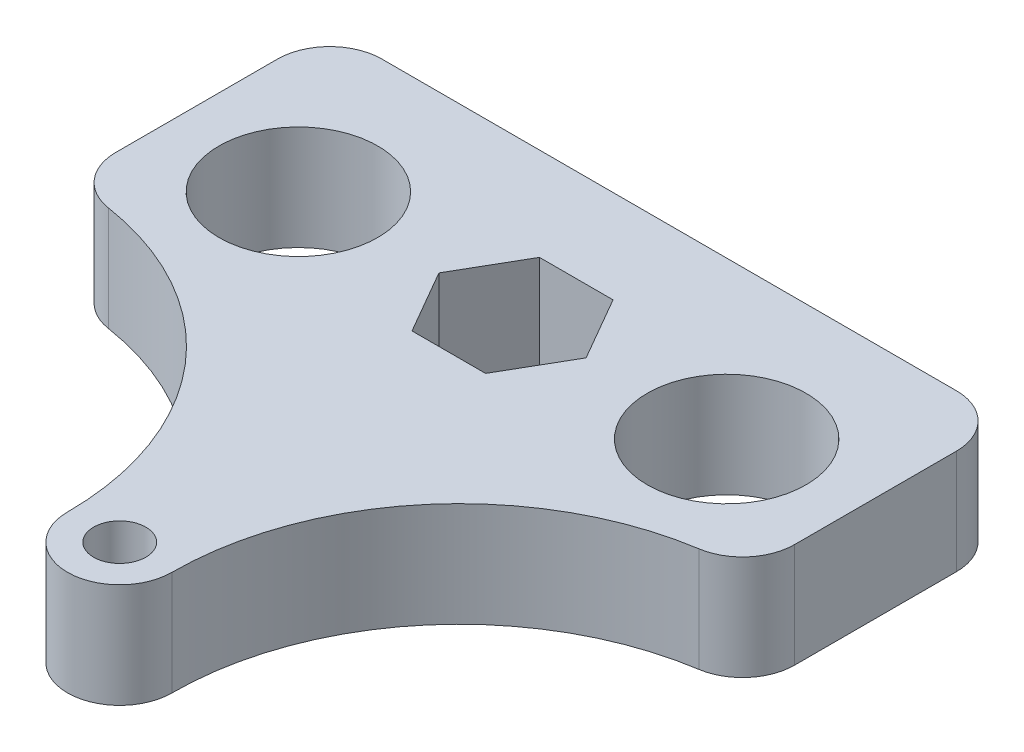
ISO-10303-21;
HEADER;
FILE_DESCRIPTION(('STEP AP214'),'2;1');
FILE_NAME('part.step','',(''),(''),'','','');
FILE_SCHEMA(('AUTOMOTIVE_DESIGN { 1 0 10303 214 1 1 1 1 }'));
ENDSEC;
DATA;
#1=APPLICATION_CONTEXT('core data for automotive mechanical design processes');
#2=APPLICATION_PROTOCOL_DEFINITION('international standard','automotive_design',2000,#1);
#3=PRODUCT_CONTEXT('',#1,'mechanical');
#4=PRODUCT('Part','Part','',(#3));
#5=PRODUCT_RELATED_PRODUCT_CATEGORY('part','',(#4));
#6=PRODUCT_DEFINITION_FORMATION('','',#4);
#7=PRODUCT_DEFINITION_CONTEXT('part definition',#1,'design');
#8=PRODUCT_DEFINITION('design','',#6,#7);
#9=PRODUCT_DEFINITION_SHAPE('','',#8);
#10=(LENGTH_UNIT() NAMED_UNIT(*) SI_UNIT(.MILLI.,.METRE.));
#11=(NAMED_UNIT(*) PLANE_ANGLE_UNIT() SI_UNIT($,.RADIAN.));
#12=(NAMED_UNIT(*) SI_UNIT($,.STERADIAN.) SOLID_ANGLE_UNIT());
#13=UNCERTAINTY_MEASURE_WITH_UNIT(LENGTH_MEASURE(1.E-05),#10,'distance_accuracy_value','');
#14=(GEOMETRIC_REPRESENTATION_CONTEXT(3) GLOBAL_UNCERTAINTY_ASSIGNED_CONTEXT((#13)) GLOBAL_UNIT_ASSIGNED_CONTEXT((#10,
#11,#12)) REPRESENTATION_CONTEXT('',''));
#15=CARTESIAN_POINT('',(0.,0.,0.));
#16=DIRECTION('',(0.,0.,1.));
#17=DIRECTION('',(1.,0.,0.));
#18=AXIS2_PLACEMENT_3D('',#15,#16,#17);
#19=CARTESIAN_POINT('',(32.5,10.,27.5));
#20=DIRECTION('',(0.,-1.,0.));
#21=DIRECTION('',(0.,0.,-1.));
#22=AXIS2_PLACEMENT_3D('',#19,#20,#21);
#23=PLANE('',#22);
#24=CARTESIAN_POINT('',(0.,10.,27.5));
#25=DIRECTION('',(0.,1.,0.));
#26=DIRECTION('',(0.,0.,1.));
#27=AXIS2_PLACEMENT_3D('',#24,#25,#26);
#28=CIRCLE('',#27,2.5);
#29=CARTESIAN_POINT('',(0.,10.,30.));
#30=VERTEX_POINT('',#29);
#31=EDGE_CURVE('E200',#30,#30,#28,.T.);
#32=ORIENTED_EDGE('',*,*,#31,.F.);
#33=EDGE_LOOP('',(#32));
#34=FACE_BOUND('',#33,.T.);
#35=CARTESIAN_POINT('',(32.5,10.,27.5));
#36=DIRECTION('',(0.,-1.,0.));
#37=DIRECTION('',(0.,0.,-1.));
#38=AXIS2_PLACEMENT_3D('',#35,#36,#37);
#39=CIRCLE('',#38,27.5);
#40=CARTESIAN_POINT('',(5.,10.,27.5));
#41=VERTEX_POINT('',#40);
#42=CARTESIAN_POINT('',(28.2692307692308,10.,0.327392622054533));
#43=VERTEX_POINT('',#42);
#44=EDGE_CURVE('E206',#41,#43,#39,.T.);
#45=ORIENTED_EDGE('',*,*,#44,.T.);
#46=CARTESIAN_POINT('',(27.5000000000001,10.,-4.61308144666283));
#47=DIRECTION('',(0.,1.,0.));
#48=DIRECTION('',(0.,0.,1.));
#49=AXIS2_PLACEMENT_3D('',#46,#47,#48);
#50=CIRCLE('',#49,5.);
#51=CARTESIAN_POINT('',(32.5000000000001,10.,-4.61308144666284));
#52=VERTEX_POINT('',#51);
#53=EDGE_CURVE('E209',#43,#52,#50,.T.);
#54=ORIENTED_EDGE('',*,*,#53,.T.);
#55=DIRECTION('',(0.,0.,-1.));
#56=VECTOR('',#55,1.);
#57=CARTESIAN_POINT('',(32.5,10.,-20.1));
#58=LINE('',#57,#56);
#59=CARTESIAN_POINT('',(32.5,10.,-20.1));
#60=VERTEX_POINT('',#59);
#61=EDGE_CURVE('E212',#52,#60,#58,.T.);
#62=ORIENTED_EDGE('',*,*,#61,.T.);
#63=CARTESIAN_POINT('',(27.5,10.,-20.1));
#64=DIRECTION('',(0.,1.,0.));
#65=DIRECTION('',(0.,0.,-1.));
#66=AXIS2_PLACEMENT_3D('',#63,#64,#65);
#67=CIRCLE('',#66,5.);
#68=CARTESIAN_POINT('',(27.5,10.,-25.1));
#69=VERTEX_POINT('',#68);
#70=EDGE_CURVE('E214',#60,#69,#67,.T.);
#71=ORIENTED_EDGE('',*,*,#70,.T.);
#72=DIRECTION('',(-1.,0.,0.));
#73=VECTOR('',#72,1.);
#74=CARTESIAN_POINT('',(-27.5,10.,-25.1));
#75=LINE('',#74,#73);
#76=CARTESIAN_POINT('',(-27.5,10.,-25.1));
#77=VERTEX_POINT('',#76);
#78=EDGE_CURVE('E216',#69,#77,#75,.T.);
#79=ORIENTED_EDGE('',*,*,#78,.T.);
#80=CARTESIAN_POINT('',(-27.5,10.,-20.1));
#81=DIRECTION('',(0.,1.,0.));
#82=DIRECTION('',(0.,0.,1.));
#83=AXIS2_PLACEMENT_3D('',#80,#81,#82);
#84=CIRCLE('',#83,5.);
#85=CARTESIAN_POINT('',(-32.5,10.,-20.1));
#86=VERTEX_POINT('',#85);
#87=EDGE_CURVE('E218',#77,#86,#84,.T.);
#88=ORIENTED_EDGE('',*,*,#87,.T.);
#89=DIRECTION('',(0.,0.,1.));
#90=VECTOR('',#89,1.);
#91=CARTESIAN_POINT('',(-32.5000000000001,10.,-4.61308144666284));
#92=LINE('',#91,#90);
#93=CARTESIAN_POINT('',(-32.5000000000001,10.,-4.61308144666284));
#94=VERTEX_POINT('',#93);
#95=EDGE_CURVE('E220',#86,#94,#92,.T.);
#96=ORIENTED_EDGE('',*,*,#95,.T.);
#97=CARTESIAN_POINT('',(-27.5000000000001,10.,-4.61308144666283));
#98=DIRECTION('',(0.,1.,0.));
#99=DIRECTION('',(0.,0.,-1.));
#100=AXIS2_PLACEMENT_3D('',#97,#98,#99);
#101=CIRCLE('',#100,5.);
#102=CARTESIAN_POINT('',(-28.2692307692308,10.,0.327392622054522));
#103=VERTEX_POINT('',#102);
#104=EDGE_CURVE('E222',#94,#103,#101,.T.);
#105=ORIENTED_EDGE('',*,*,#104,.T.);
#106=CARTESIAN_POINT('',(-32.5,10.,27.5));
#107=DIRECTION('',(0.,-1.,0.));
#108=DIRECTION('',(0.,0.,1.));
#109=AXIS2_PLACEMENT_3D('',#106,#107,#108);
#110=CIRCLE('',#109,27.5);
#111=CARTESIAN_POINT('',(-4.99999999999999,10.,27.5));
#112=VERTEX_POINT('',#111);
#113=EDGE_CURVE('E224',#103,#112,#110,.T.);
#114=ORIENTED_EDGE('',*,*,#113,.T.);
#115=CARTESIAN_POINT('',(0.,10.,27.5));
#116=DIRECTION('',(0.,1.,0.));
#117=DIRECTION('',(0.,0.,1.));
#118=AXIS2_PLACEMENT_3D('',#115,#116,#117);
#119=CIRCLE('',#118,4.99999999999999);
#120=EDGE_CURVE('E226',#112,#41,#119,.T.);
#121=ORIENTED_EDGE('',*,*,#120,.T.);
#122=EDGE_LOOP('',(#45,#54,#62,#71,#79,#88,#96,#105,#114,#121));
#123=FACE_BOUND('',#122,.T.);
#124=DIRECTION('',(0.5,0.,-0.866025403784439));
#125=VECTOR('',#124,1.);
#126=CARTESIAN_POINT('',(3.52183664205672,10.,-4.));
#127=LINE('',#126,#125);
#128=CARTESIAN_POINT('',(3.52183664205672,10.,-4.));
#129=VERTEX_POINT('',#128);
#130=CARTESIAN_POINT('',(7.04367328411344,10.,-10.1));
#131=VERTEX_POINT('',#130);
#132=EDGE_CURVE('E146',#129,#131,#127,.T.);
#133=ORIENTED_EDGE('',*,*,#132,.F.);
#134=DIRECTION('',(1.,0.,0.));
#135=VECTOR('',#134,1.);
#136=CARTESIAN_POINT('',(-3.52183664205672,10.,-4.));
#137=LINE('',#136,#135);
#138=CARTESIAN_POINT('',(-3.52183664205671,10.,-4.));
#139=VERTEX_POINT('',#138);
#140=EDGE_CURVE('E177',#139,#129,#137,.T.);
#141=ORIENTED_EDGE('',*,*,#140,.F.);
#142=DIRECTION('',(0.5,0.,0.866025403784439));
#143=VECTOR('',#142,1.);
#144=CARTESIAN_POINT('',(-7.04367328411344,10.,-10.1));
#145=LINE('',#144,#143);
#146=CARTESIAN_POINT('',(-7.04367328411344,10.,-10.1));
#147=VERTEX_POINT('',#146);
#148=EDGE_CURVE('E175',#147,#139,#145,.T.);
#149=ORIENTED_EDGE('',*,*,#148,.F.);
#150=DIRECTION('',(-0.5,0.,0.866025403784439));
#151=VECTOR('',#150,1.);
#152=CARTESIAN_POINT('',(-3.52183664205672,10.,-16.2));
#153=LINE('',#152,#151);
#154=CARTESIAN_POINT('',(-3.52183664205672,10.,-16.2));
#155=VERTEX_POINT('',#154);
#156=EDGE_CURVE('E170',#155,#147,#153,.T.);
#157=ORIENTED_EDGE('',*,*,#156,.F.);
#158=DIRECTION('',(-1.,0.,0.));
#159=VECTOR('',#158,1.);
#160=CARTESIAN_POINT('',(3.52183664205672,10.,-16.2));
#161=LINE('',#160,#159);
#162=CARTESIAN_POINT('',(3.52183664205672,10.,-16.2));
#163=VERTEX_POINT('',#162);
#164=EDGE_CURVE('E168',#163,#155,#161,.T.);
#165=ORIENTED_EDGE('',*,*,#164,.F.);
#166=DIRECTION('',(-0.5,0.,-0.866025403784439));
#167=VECTOR('',#166,1.);
#168=CARTESIAN_POINT('',(7.04367328411344,10.,-10.1));
#169=LINE('',#168,#167);
#170=EDGE_CURVE('E154',#131,#163,#169,.T.);
#171=ORIENTED_EDGE('',*,*,#170,.F.);
#172=EDGE_LOOP('',(#133,#141,#149,#157,#165,#171));
#173=FACE_BOUND('',#172,.T.);
#174=CARTESIAN_POINT('',(-20.5,10.,-10.1));
#175=DIRECTION('',(0.,1.,0.));
#176=DIRECTION('',(0.,0.,1.));
#177=AXIS2_PLACEMENT_3D('',#174,#175,#176);
#178=CIRCLE('',#177,7.6);
#179=CARTESIAN_POINT('',(-20.5,10.,-2.5));
#180=VERTEX_POINT('',#179);
#181=EDGE_CURVE('E180',#180,#180,#178,.T.);
#182=ORIENTED_EDGE('',*,*,#181,.F.);
#183=EDGE_LOOP('',(#182));
#184=FACE_BOUND('',#183,.T.);
#185=CARTESIAN_POINT('',(20.5,10.,-10.1));
#186=DIRECTION('',(0.,1.,0.));
#187=DIRECTION('',(0.,0.,1.));
#188=AXIS2_PLACEMENT_3D('',#185,#186,#187);
#189=CIRCLE('',#188,7.6);
#190=CARTESIAN_POINT('',(20.5,10.,-2.5));
#191=VERTEX_POINT('',#190);
#192=EDGE_CURVE('E507',#191,#191,#189,.T.);
#193=ORIENTED_EDGE('',*,*,#192,.F.);
#194=EDGE_LOOP('',(#193));
#195=FACE_BOUND('',#194,.T.);
#196=ADVANCED_FACE('F33',(#34,#123,#173,#184,#195),#23,.F.);
#197=CARTESIAN_POINT('',(32.5,0.,27.5));
#198=DIRECTION('',(0.,-1.,0.));
#199=DIRECTION('',(0.,0.,-1.));
#200=AXIS2_PLACEMENT_3D('',#197,#198,#199);
#201=PLANE('',#200);
#202=CARTESIAN_POINT('',(-20.5,0.,-10.1));
#203=DIRECTION('',(0.,1.,0.));
#204=DIRECTION('',(0.,0.,1.));
#205=AXIS2_PLACEMENT_3D('',#202,#203,#204);
#206=CIRCLE('',#205,7.6);
#207=CARTESIAN_POINT('',(-20.5,0.,-2.5));
#208=VERTEX_POINT('',#207);
#209=EDGE_CURVE('E513',#208,#208,#206,.T.);
#210=ORIENTED_EDGE('',*,*,#209,.T.);
#211=EDGE_LOOP('',(#210));
#212=FACE_BOUND('',#211,.T.);
#213=CARTESIAN_POINT('',(32.5,0.,27.5));
#214=DIRECTION('',(0.,-1.,0.));
#215=DIRECTION('',(0.,0.,-1.));
#216=AXIS2_PLACEMENT_3D('',#213,#214,#215);
#217=CIRCLE('',#216,27.5);
#218=CARTESIAN_POINT('',(5.,0.,27.5));
#219=VERTEX_POINT('',#218);
#220=CARTESIAN_POINT('',(28.2692307692308,0.,0.327392622054533));
#221=VERTEX_POINT('',#220);
#222=EDGE_CURVE('E203',#219,#221,#217,.T.);
#223=ORIENTED_EDGE('',*,*,#222,.F.);
#224=CARTESIAN_POINT('',(0.,0.,27.5));
#225=DIRECTION('',(0.,1.,0.));
#226=DIRECTION('',(0.,0.,1.));
#227=AXIS2_PLACEMENT_3D('',#224,#225,#226);
#228=CIRCLE('',#227,4.99999999999999);
#229=CARTESIAN_POINT('',(-4.99999999999999,0.,27.5));
#230=VERTEX_POINT('',#229);
#231=EDGE_CURVE('E210',#230,#219,#228,.T.);
#232=ORIENTED_EDGE('',*,*,#231,.F.);
#233=CARTESIAN_POINT('',(-32.5,0.,27.5));
#234=DIRECTION('',(0.,-1.,0.));
#235=DIRECTION('',(0.,0.,1.));
#236=AXIS2_PLACEMENT_3D('',#233,#234,#235);
#237=CIRCLE('',#236,27.5);
#238=CARTESIAN_POINT('',(-28.2692307692308,0.,0.327392622054522));
#239=VERTEX_POINT('',#238);
#240=EDGE_CURVE('E245',#239,#230,#237,.T.);
#241=ORIENTED_EDGE('',*,*,#240,.F.);
#242=CARTESIAN_POINT('',(-27.5000000000001,0.,-4.61308144666283));
#243=DIRECTION('',(0.,1.,0.));
#244=DIRECTION('',(0.,0.,-1.));
#245=AXIS2_PLACEMENT_3D('',#242,#243,#244);
#246=CIRCLE('',#245,5.);
#247=CARTESIAN_POINT('',(-32.5000000000001,0.,-4.61308144666284));
#248=VERTEX_POINT('',#247);
#249=EDGE_CURVE('E243',#248,#239,#246,.T.);
#250=ORIENTED_EDGE('',*,*,#249,.F.);
#251=DIRECTION('',(0.,0.,1.));
#252=VECTOR('',#251,1.);
#253=CARTESIAN_POINT('',(-32.5000000000001,0.,-4.61308144666284));
#254=LINE('',#253,#252);
#255=CARTESIAN_POINT('',(-32.5,0.,-20.1));
#256=VERTEX_POINT('',#255);
#257=EDGE_CURVE('E241',#256,#248,#254,.T.);
#258=ORIENTED_EDGE('',*,*,#257,.F.);
#259=CARTESIAN_POINT('',(-27.5,0.,-20.1));
#260=DIRECTION('',(0.,1.,0.));
#261=DIRECTION('',(0.,0.,1.));
#262=AXIS2_PLACEMENT_3D('',#259,#260,#261);
#263=CIRCLE('',#262,5.);
#264=CARTESIAN_POINT('',(-27.5,0.,-25.1));
#265=VERTEX_POINT('',#264);
#266=EDGE_CURVE('E239',#265,#256,#263,.T.);
#267=ORIENTED_EDGE('',*,*,#266,.F.);
#268=DIRECTION('',(-1.,0.,0.));
#269=VECTOR('',#268,1.);
#270=CARTESIAN_POINT('',(-27.5,0.,-25.1));
#271=LINE('',#270,#269);
#272=CARTESIAN_POINT('',(27.5,0.,-25.1));
#273=VERTEX_POINT('',#272);
#274=EDGE_CURVE('E237',#273,#265,#271,.T.);
#275=ORIENTED_EDGE('',*,*,#274,.F.);
#276=CARTESIAN_POINT('',(27.5,0.,-20.1));
#277=DIRECTION('',(0.,1.,0.));
#278=DIRECTION('',(0.,0.,-1.));
#279=AXIS2_PLACEMENT_3D('',#276,#277,#278);
#280=CIRCLE('',#279,5.);
#281=CARTESIAN_POINT('',(32.5,0.,-20.1));
#282=VERTEX_POINT('',#281);
#283=EDGE_CURVE('E235',#282,#273,#280,.T.);
#284=ORIENTED_EDGE('',*,*,#283,.F.);
#285=DIRECTION('',(0.,0.,-1.));
#286=VECTOR('',#285,1.);
#287=CARTESIAN_POINT('',(32.5,0.,-20.1));
#288=LINE('',#287,#286);
#289=CARTESIAN_POINT('',(32.5000000000001,0.,-4.61308144666284));
#290=VERTEX_POINT('',#289);
#291=EDGE_CURVE('E233',#290,#282,#288,.T.);
#292=ORIENTED_EDGE('',*,*,#291,.F.);
#293=CARTESIAN_POINT('',(27.5000000000001,0.,-4.61308144666283));
#294=DIRECTION('',(0.,1.,0.));
#295=DIRECTION('',(0.,0.,1.));
#296=AXIS2_PLACEMENT_3D('',#293,#294,#295);
#297=CIRCLE('',#296,5.);
#298=EDGE_CURVE('E231',#221,#290,#297,.T.);
#299=ORIENTED_EDGE('',*,*,#298,.F.);
#300=EDGE_LOOP('',(#223,#232,#241,#250,#258,#267,#275,#284,#292,#299));
#301=FACE_BOUND('',#300,.T.);
#302=CARTESIAN_POINT('',(0.,0.,27.5));
#303=DIRECTION('',(0.,1.,0.));
#304=DIRECTION('',(0.,0.,1.));
#305=AXIS2_PLACEMENT_3D('',#302,#303,#304);
#306=CIRCLE('',#305,2.5);
#307=CARTESIAN_POINT('',(0.,0.,30.));
#308=VERTEX_POINT('',#307);
#309=EDGE_CURVE('E162',#308,#308,#306,.T.);
#310=ORIENTED_EDGE('',*,*,#309,.T.);
#311=EDGE_LOOP('',(#310));
#312=FACE_BOUND('',#311,.T.);
#313=DIRECTION('',(1.,0.,0.));
#314=VECTOR('',#313,1.);
#315=CARTESIAN_POINT('',(-3.52183664205672,0.,-4.));
#316=LINE('',#315,#314);
#317=CARTESIAN_POINT('',(-3.52183664205672,0.,-4.));
#318=VERTEX_POINT('',#317);
#319=CARTESIAN_POINT('',(3.52183664205672,0.,-4.));
#320=VERTEX_POINT('',#319);
#321=EDGE_CURVE('E155',#318,#320,#316,.T.);
#322=ORIENTED_EDGE('',*,*,#321,.T.);
#323=DIRECTION('',(0.5,0.,-0.866025403784439));
#324=VECTOR('',#323,1.);
#325=CARTESIAN_POINT('',(3.52183664205672,0.,-4.));
#326=LINE('',#325,#324);
#327=CARTESIAN_POINT('',(7.04367328411344,0.,-10.1));
#328=VERTEX_POINT('',#327);
#329=EDGE_CURVE('E56',#320,#328,#326,.T.);
#330=ORIENTED_EDGE('',*,*,#329,.T.);
#331=DIRECTION('',(-0.5,0.,-0.866025403784439));
#332=VECTOR('',#331,1.);
#333=CARTESIAN_POINT('',(7.04367328411344,0.,-10.1));
#334=LINE('',#333,#332);
#335=CARTESIAN_POINT('',(3.52183664205672,0.,-16.2));
#336=VERTEX_POINT('',#335);
#337=EDGE_CURVE('E161',#328,#336,#334,.T.);
#338=ORIENTED_EDGE('',*,*,#337,.T.);
#339=DIRECTION('',(-1.,0.,0.));
#340=VECTOR('',#339,1.);
#341=CARTESIAN_POINT('',(3.52183664205672,0.,-16.2));
#342=LINE('',#341,#340);
#343=CARTESIAN_POINT('',(-3.52183664205672,0.,-16.2));
#344=VERTEX_POINT('',#343);
#345=EDGE_CURVE('E182',#336,#344,#342,.T.);
#346=ORIENTED_EDGE('',*,*,#345,.T.);
#347=DIRECTION('',(-0.5,0.,0.866025403784439));
#348=VECTOR('',#347,1.);
#349=CARTESIAN_POINT('',(-3.52183664205672,0.,-16.2));
#350=LINE('',#349,#348);
#351=CARTESIAN_POINT('',(-7.04367328411344,0.,-10.1));
#352=VERTEX_POINT('',#351);
#353=EDGE_CURVE('E185',#344,#352,#350,.T.);
#354=ORIENTED_EDGE('',*,*,#353,.T.);
#355=DIRECTION('',(0.5,0.,0.866025403784439));
#356=VECTOR('',#355,1.);
#357=CARTESIAN_POINT('',(-7.04367328411344,0.,-10.1));
#358=LINE('',#357,#356);
#359=EDGE_CURVE('E188',#352,#318,#358,.T.);
#360=ORIENTED_EDGE('',*,*,#359,.T.);
#361=EDGE_LOOP('',(#322,#330,#338,#346,#354,#360));
#362=FACE_BOUND('',#361,.T.);
#363=CARTESIAN_POINT('',(20.5,0.,-10.1));
#364=DIRECTION('',(0.,1.,0.));
#365=DIRECTION('',(0.,0.,1.));
#366=AXIS2_PLACEMENT_3D('',#363,#364,#365);
#367=CIRCLE('',#366,7.6);
#368=CARTESIAN_POINT('',(20.5,0.,-2.5));
#369=VERTEX_POINT('',#368);
#370=EDGE_CURVE('E510',#369,#369,#367,.T.);
#371=ORIENTED_EDGE('',*,*,#370,.T.);
#372=EDGE_LOOP('',(#371));
#373=FACE_BOUND('',#372,.T.);
#374=ADVANCED_FACE('F281',(#212,#301,#312,#362,#373),#201,.T.);
#375=CARTESIAN_POINT('',(32.5,10.,27.5));
#376=DIRECTION('',(0.,-1.,0.));
#377=DIRECTION('',(0.,0.,-1.));
#378=AXIS2_PLACEMENT_3D('',#375,#376,#377);
#379=CYLINDRICAL_SURFACE('',#378,27.5);
#380=ORIENTED_EDGE('',*,*,#222,.T.);
#381=DIRECTION('',(0.,-1.,0.));
#382=VECTOR('',#381,1.);
#383=CARTESIAN_POINT('',(28.2692307692308,10.,0.327392622054533));
#384=LINE('',#383,#382);
#385=EDGE_CURVE('E11',#43,#221,#384,.T.);
#386=ORIENTED_EDGE('',*,*,#385,.F.);
#387=ORIENTED_EDGE('',*,*,#44,.F.);
#388=DIRECTION('',(0.,-1.,0.));
#389=VECTOR('',#388,1.);
#390=CARTESIAN_POINT('',(5.,10.,27.5));
#391=LINE('',#390,#389);
#392=EDGE_CURVE('E228',#41,#219,#391,.T.);
#393=ORIENTED_EDGE('',*,*,#392,.T.);
#394=EDGE_LOOP('',(#380,#386,#387,#393));
#395=FACE_BOUND('',#394,.T.);
#396=ADVANCED_FACE('F35',(#395),#379,.F.);
#397=CARTESIAN_POINT('',(27.5000000000001,10.,-4.61308144666283));
#398=DIRECTION('',(0.,-1.,0.));
#399=DIRECTION('',(0.,0.,-1.));
#400=AXIS2_PLACEMENT_3D('',#397,#398,#399);
#401=CYLINDRICAL_SURFACE('',#400,5.);
#402=ORIENTED_EDGE('',*,*,#298,.T.);
#403=DIRECTION('',(0.,-1.,0.));
#404=VECTOR('',#403,1.);
#405=CARTESIAN_POINT('',(32.5000000000001,10.,-4.61308144666284));
#406=LINE('',#405,#404);
#407=EDGE_CURVE('E41',#52,#290,#406,.T.);
#408=ORIENTED_EDGE('',*,*,#407,.F.);
#409=ORIENTED_EDGE('',*,*,#53,.F.);
#410=ORIENTED_EDGE('',*,*,#385,.T.);
#411=EDGE_LOOP('',(#402,#408,#409,#410));
#412=FACE_BOUND('',#411,.T.);
#413=ADVANCED_FACE('F298',(#412),#401,.T.);
#414=CARTESIAN_POINT('',(32.5,10.,-20.1));
#415=DIRECTION('',(-1.,0.,0.));
#416=DIRECTION('',(0.,0.,1.));
#417=AXIS2_PLACEMENT_3D('',#414,#415,#416);
#418=PLANE('',#417);
#419=ORIENTED_EDGE('',*,*,#291,.T.);
#420=DIRECTION('',(0.,-1.,0.));
#421=VECTOR('',#420,1.);
#422=CARTESIAN_POINT('',(32.5,10.,-20.1));
#423=LINE('',#422,#421);
#424=EDGE_CURVE('E268',#60,#282,#423,.T.);
#425=ORIENTED_EDGE('',*,*,#424,.F.);
#426=ORIENTED_EDGE('',*,*,#61,.F.);
#427=ORIENTED_EDGE('',*,*,#407,.T.);
#428=EDGE_LOOP('',(#419,#425,#426,#427));
#429=FACE_BOUND('',#428,.T.);
#430=ADVANCED_FACE('F275',(#429),#418,.F.);
#431=CARTESIAN_POINT('',(27.5,10.,-20.1));
#432=DIRECTION('',(0.,-1.,0.));
#433=DIRECTION('',(0.,0.,-1.));
#434=AXIS2_PLACEMENT_3D('',#431,#432,#433);
#435=CYLINDRICAL_SURFACE('',#434,5.);
#436=ORIENTED_EDGE('',*,*,#283,.T.);
#437=DIRECTION('',(0.,-1.,0.));
#438=VECTOR('',#437,1.);
#439=CARTESIAN_POINT('',(27.5,10.,-25.1));
#440=LINE('',#439,#438);
#441=EDGE_CURVE('E265',#69,#273,#440,.T.);
#442=ORIENTED_EDGE('',*,*,#441,.F.);
#443=ORIENTED_EDGE('',*,*,#70,.F.);
#444=ORIENTED_EDGE('',*,*,#424,.T.);
#445=EDGE_LOOP('',(#436,#442,#443,#444));
#446=FACE_BOUND('',#445,.T.);
#447=ADVANCED_FACE('F287',(#446),#435,.T.);
#448=CARTESIAN_POINT('',(-27.5,10.,-25.1));
#449=DIRECTION('',(0.,0.,1.));
#450=DIRECTION('',(1.,0.,0.));
#451=AXIS2_PLACEMENT_3D('',#448,#449,#450);
#452=PLANE('',#451);
#453=ORIENTED_EDGE('',*,*,#274,.T.);
#454=DIRECTION('',(0.,-1.,0.));
#455=VECTOR('',#454,1.);
#456=CARTESIAN_POINT('',(-27.5,10.,-25.1));
#457=LINE('',#456,#455);
#458=EDGE_CURVE('E262',#77,#265,#457,.T.);
#459=ORIENTED_EDGE('',*,*,#458,.F.);
#460=ORIENTED_EDGE('',*,*,#78,.F.);
#461=ORIENTED_EDGE('',*,*,#441,.T.);
#462=EDGE_LOOP('',(#453,#459,#460,#461));
#463=FACE_BOUND('',#462,.T.);
#464=ADVANCED_FACE('F291',(#463),#452,.F.);
#465=CARTESIAN_POINT('',(-27.5,10.,-20.1));
#466=DIRECTION('',(0.,-1.,0.));
#467=DIRECTION('',(0.,0.,-1.));
#468=AXIS2_PLACEMENT_3D('',#465,#466,#467);
#469=CYLINDRICAL_SURFACE('',#468,5.);
#470=ORIENTED_EDGE('',*,*,#266,.T.);
#471=DIRECTION('',(0.,-1.,0.));
#472=VECTOR('',#471,1.);
#473=CARTESIAN_POINT('',(-32.5,10.,-20.1));
#474=LINE('',#473,#472);
#475=EDGE_CURVE('E259',#86,#256,#474,.T.);
#476=ORIENTED_EDGE('',*,*,#475,.F.);
#477=ORIENTED_EDGE('',*,*,#87,.F.);
#478=ORIENTED_EDGE('',*,*,#458,.T.);
#479=EDGE_LOOP('',(#470,#476,#477,#478));
#480=FACE_BOUND('',#479,.T.);
#481=ADVANCED_FACE('F321',(#480),#469,.T.);
#482=CARTESIAN_POINT('',(-32.5000000000001,10.,-4.61308144666284));
#483=DIRECTION('',(1.,0.,0.));
#484=DIRECTION('',(0.,0.,-1.));
#485=AXIS2_PLACEMENT_3D('',#482,#483,#484);
#486=PLANE('',#485);
#487=ORIENTED_EDGE('',*,*,#257,.T.);
#488=DIRECTION('',(0.,-1.,0.));
#489=VECTOR('',#488,1.);
#490=CARTESIAN_POINT('',(-32.5000000000001,10.,-4.61308144666284));
#491=LINE('',#490,#489);
#492=EDGE_CURVE('E256',#94,#248,#491,.T.);
#493=ORIENTED_EDGE('',*,*,#492,.F.);
#494=ORIENTED_EDGE('',*,*,#95,.F.);
#495=ORIENTED_EDGE('',*,*,#475,.T.);
#496=EDGE_LOOP('',(#487,#493,#494,#495));
#497=FACE_BOUND('',#496,.T.);
#498=ADVANCED_FACE('F318',(#497),#486,.F.);
#499=CARTESIAN_POINT('',(-27.5000000000001,10.,-4.61308144666283));
#500=DIRECTION('',(0.,-1.,0.));
#501=DIRECTION('',(0.,0.,-1.));
#502=AXIS2_PLACEMENT_3D('',#499,#500,#501);
#503=CYLINDRICAL_SURFACE('',#502,5.);
#504=ORIENTED_EDGE('',*,*,#249,.T.);
#505=DIRECTION('',(0.,-1.,0.));
#506=VECTOR('',#505,1.);
#507=CARTESIAN_POINT('',(-28.2692307692308,10.,0.327392622054522));
#508=LINE('',#507,#506);
#509=EDGE_CURVE('E253',#103,#239,#508,.T.);
#510=ORIENTED_EDGE('',*,*,#509,.F.);
#511=ORIENTED_EDGE('',*,*,#104,.F.);
#512=ORIENTED_EDGE('',*,*,#492,.T.);
#513=EDGE_LOOP('',(#504,#510,#511,#512));
#514=FACE_BOUND('',#513,.T.);
#515=ADVANCED_FACE('F314',(#514),#503,.T.);
#516=CARTESIAN_POINT('',(-32.5,10.,27.5));
#517=DIRECTION('',(0.,-1.,0.));
#518=DIRECTION('',(0.,0.,-1.));
#519=AXIS2_PLACEMENT_3D('',#516,#517,#518);
#520=CYLINDRICAL_SURFACE('',#519,27.5);
#521=ORIENTED_EDGE('',*,*,#240,.T.);
#522=DIRECTION('',(0.,-1.,0.));
#523=VECTOR('',#522,1.);
#524=CARTESIAN_POINT('',(-4.99999999999999,10.,27.5));
#525=LINE('',#524,#523);
#526=EDGE_CURVE('E250',#112,#230,#525,.T.);
#527=ORIENTED_EDGE('',*,*,#526,.F.);
#528=ORIENTED_EDGE('',*,*,#113,.F.);
#529=ORIENTED_EDGE('',*,*,#509,.T.);
#530=EDGE_LOOP('',(#521,#527,#528,#529));
#531=FACE_BOUND('',#530,.T.);
#532=ADVANCED_FACE('F310',(#531),#520,.F.);
#533=CARTESIAN_POINT('',(0.,10.,27.5));
#534=DIRECTION('',(0.,-1.,0.));
#535=DIRECTION('',(0.,0.,-1.));
#536=AXIS2_PLACEMENT_3D('',#533,#534,#535);
#537=CYLINDRICAL_SURFACE('',#536,4.99999999999999);
#538=ORIENTED_EDGE('',*,*,#231,.T.);
#539=ORIENTED_EDGE('',*,*,#392,.F.);
#540=ORIENTED_EDGE('',*,*,#120,.F.);
#541=ORIENTED_EDGE('',*,*,#526,.T.);
#542=EDGE_LOOP('',(#538,#539,#540,#541));
#543=FACE_BOUND('',#542,.T.);
#544=ADVANCED_FACE('F305',(#543),#537,.T.);
#545=CARTESIAN_POINT('',(0.,10.,27.5));
#546=DIRECTION('',(0.,-1.,0.));
#547=DIRECTION('',(0.,0.,-1.));
#548=AXIS2_PLACEMENT_3D('',#545,#546,#547);
#549=CYLINDRICAL_SURFACE('',#548,2.5);
#550=ORIENTED_EDGE('',*,*,#31,.T.);
#551=EDGE_LOOP('',(#550));
#552=FACE_BOUND('',#551,.T.);
#553=ORIENTED_EDGE('',*,*,#309,.F.);
#554=EDGE_LOOP('',(#553));
#555=FACE_BOUND('',#554,.T.);
#556=ADVANCED_FACE('F340',(#552,#555),#549,.F.);
#557=CARTESIAN_POINT('',(3.52183664205672,10.,-4.));
#558=DIRECTION('',(-0.866025403784439,0.,-0.5));
#559=DIRECTION('',(-0.5,0.,0.866025403784439));
#560=AXIS2_PLACEMENT_3D('',#557,#558,#559);
#561=PLANE('',#560);
#562=ORIENTED_EDGE('',*,*,#329,.F.);
#563=DIRECTION('',(0.,-1.,0.));
#564=VECTOR('',#563,1.);
#565=CARTESIAN_POINT('',(3.52183664205672,10.,-4.));
#566=LINE('',#565,#564);
#567=EDGE_CURVE('E150',#129,#320,#566,.T.);
#568=ORIENTED_EDGE('',*,*,#567,.F.);
#569=ORIENTED_EDGE('',*,*,#132,.T.);
#570=DIRECTION('',(0.,-1.,0.));
#571=VECTOR('',#570,1.);
#572=CARTESIAN_POINT('',(7.04367328411344,10.,-10.1));
#573=LINE('',#572,#571);
#574=EDGE_CURVE('E149',#131,#328,#573,.T.);
#575=ORIENTED_EDGE('',*,*,#574,.T.);
#576=EDGE_LOOP('',(#562,#568,#569,#575));
#577=FACE_BOUND('',#576,.T.);
#578=ADVANCED_FACE('F148',(#577),#561,.T.);
#579=CARTESIAN_POINT('',(7.04367328411344,10.,-10.1));
#580=DIRECTION('',(-0.866025403784439,0.,0.5));
#581=DIRECTION('',(0.5,0.,0.866025403784439));
#582=AXIS2_PLACEMENT_3D('',#579,#580,#581);
#583=PLANE('',#582);
#584=ORIENTED_EDGE('',*,*,#337,.F.);
#585=ORIENTED_EDGE('',*,*,#574,.F.);
#586=ORIENTED_EDGE('',*,*,#170,.T.);
#587=DIRECTION('',(0.,-1.,0.));
#588=VECTOR('',#587,1.);
#589=CARTESIAN_POINT('',(3.52183664205672,10.,-16.2));
#590=LINE('',#589,#588);
#591=EDGE_CURVE('E163',#163,#336,#590,.T.);
#592=ORIENTED_EDGE('',*,*,#591,.T.);
#593=EDGE_LOOP('',(#584,#585,#586,#592));
#594=FACE_BOUND('',#593,.T.);
#595=ADVANCED_FACE('F158',(#594),#583,.T.);
#596=CARTESIAN_POINT('',(3.52183664205672,10.,-16.2));
#597=DIRECTION('',(0.,0.,1.));
#598=DIRECTION('',(1.,0.,0.));
#599=AXIS2_PLACEMENT_3D('',#596,#597,#598);
#600=PLANE('',#599);
#601=ORIENTED_EDGE('',*,*,#345,.F.);
#602=ORIENTED_EDGE('',*,*,#591,.F.);
#603=ORIENTED_EDGE('',*,*,#164,.T.);
#604=DIRECTION('',(0.,-1.,0.));
#605=VECTOR('',#604,1.);
#606=CARTESIAN_POINT('',(-3.52183664205672,10.,-16.2));
#607=LINE('',#606,#605);
#608=EDGE_CURVE('E197',#155,#344,#607,.T.);
#609=ORIENTED_EDGE('',*,*,#608,.T.);
#610=EDGE_LOOP('',(#601,#602,#603,#609));
#611=FACE_BOUND('',#610,.T.);
#612=ADVANCED_FACE('F377',(#611),#600,.T.);
#613=CARTESIAN_POINT('',(-3.52183664205672,10.,-16.2));
#614=DIRECTION('',(0.866025403784439,0.,0.5));
#615=DIRECTION('',(0.5,0.,-0.866025403784439));
#616=AXIS2_PLACEMENT_3D('',#613,#614,#615);
#617=PLANE('',#616);
#618=ORIENTED_EDGE('',*,*,#353,.F.);
#619=ORIENTED_EDGE('',*,*,#608,.F.);
#620=ORIENTED_EDGE('',*,*,#156,.T.);
#621=DIRECTION('',(0.,-1.,0.));
#622=VECTOR('',#621,1.);
#623=CARTESIAN_POINT('',(-7.04367328411344,10.,-10.1));
#624=LINE('',#623,#622);
#625=EDGE_CURVE('E195',#147,#352,#624,.T.);
#626=ORIENTED_EDGE('',*,*,#625,.T.);
#627=EDGE_LOOP('',(#618,#619,#620,#626));
#628=FACE_BOUND('',#627,.T.);
#629=ADVANCED_FACE('F384',(#628),#617,.T.);
#630=CARTESIAN_POINT('',(-7.04367328411344,10.,-10.1));
#631=DIRECTION('',(0.866025403784439,0.,-0.5));
#632=DIRECTION('',(-0.5,0.,-0.866025403784439));
#633=AXIS2_PLACEMENT_3D('',#630,#631,#632);
#634=PLANE('',#633);
#635=ORIENTED_EDGE('',*,*,#359,.F.);
#636=ORIENTED_EDGE('',*,*,#625,.F.);
#637=ORIENTED_EDGE('',*,*,#148,.T.);
#638=DIRECTION('',(0.,-1.,0.));
#639=VECTOR('',#638,1.);
#640=CARTESIAN_POINT('',(-3.52183664205672,10.,-4.));
#641=LINE('',#640,#639);
#642=EDGE_CURVE('E48',#139,#318,#641,.T.);
#643=ORIENTED_EDGE('',*,*,#642,.T.);
#644=EDGE_LOOP('',(#635,#636,#637,#643));
#645=FACE_BOUND('',#644,.T.);
#646=ADVANCED_FACE('F392',(#645),#634,.T.);
#647=CARTESIAN_POINT('',(-3.52183664205672,10.,-4.));
#648=DIRECTION('',(0.,0.,-1.));
#649=DIRECTION('',(-1.,0.,0.));
#650=AXIS2_PLACEMENT_3D('',#647,#648,#649);
#651=PLANE('',#650);
#652=ORIENTED_EDGE('',*,*,#321,.F.);
#653=ORIENTED_EDGE('',*,*,#642,.F.);
#654=ORIENTED_EDGE('',*,*,#140,.T.);
#655=ORIENTED_EDGE('',*,*,#567,.T.);
#656=EDGE_LOOP('',(#652,#653,#654,#655));
#657=FACE_BOUND('',#656,.T.);
#658=ADVANCED_FACE('F400',(#657),#651,.T.);
#659=CARTESIAN_POINT('',(-20.5,10.,-10.1));
#660=DIRECTION('',(0.,-1.,0.));
#661=DIRECTION('',(0.,0.,-1.));
#662=AXIS2_PLACEMENT_3D('',#659,#660,#661);
#663=CYLINDRICAL_SURFACE('',#662,7.6);
#664=ORIENTED_EDGE('',*,*,#181,.T.);
#665=EDGE_LOOP('',(#664));
#666=FACE_BOUND('',#665,.T.);
#667=ORIENTED_EDGE('',*,*,#209,.F.);
#668=EDGE_LOOP('',(#667));
#669=FACE_BOUND('',#668,.T.);
#670=ADVANCED_FACE('F408',(#666,#669),#663,.F.);
#671=CARTESIAN_POINT('',(20.5,10.,-10.1));
#672=DIRECTION('',(0.,-1.,0.));
#673=DIRECTION('',(0.,0.,-1.));
#674=AXIS2_PLACEMENT_3D('',#671,#672,#673);
#675=CYLINDRICAL_SURFACE('',#674,7.6);
#676=ORIENTED_EDGE('',*,*,#192,.T.);
#677=EDGE_LOOP('',(#676));
#678=FACE_BOUND('',#677,.T.);
#679=ORIENTED_EDGE('',*,*,#370,.F.);
#680=EDGE_LOOP('',(#679));
#681=FACE_BOUND('',#680,.T.);
#682=ADVANCED_FACE('F415',(#678,#681),#675,.F.);
#683=CLOSED_SHELL('',(#196,#374,#396,#413,#430,#447,#464,#481,#498,#515,#532,#544,#556,#578,
#595,#612,#629,#646,#658,#670,#682));
#684=MANIFOLD_SOLID_BREP('B2',#683);
#685=ADVANCED_BREP_SHAPE_REPRESENTATION('',(#18,#684),#14);
#686=SHAPE_DEFINITION_REPRESENTATION(#9,#685);
ENDSEC;
END-ISO-10303-21;
